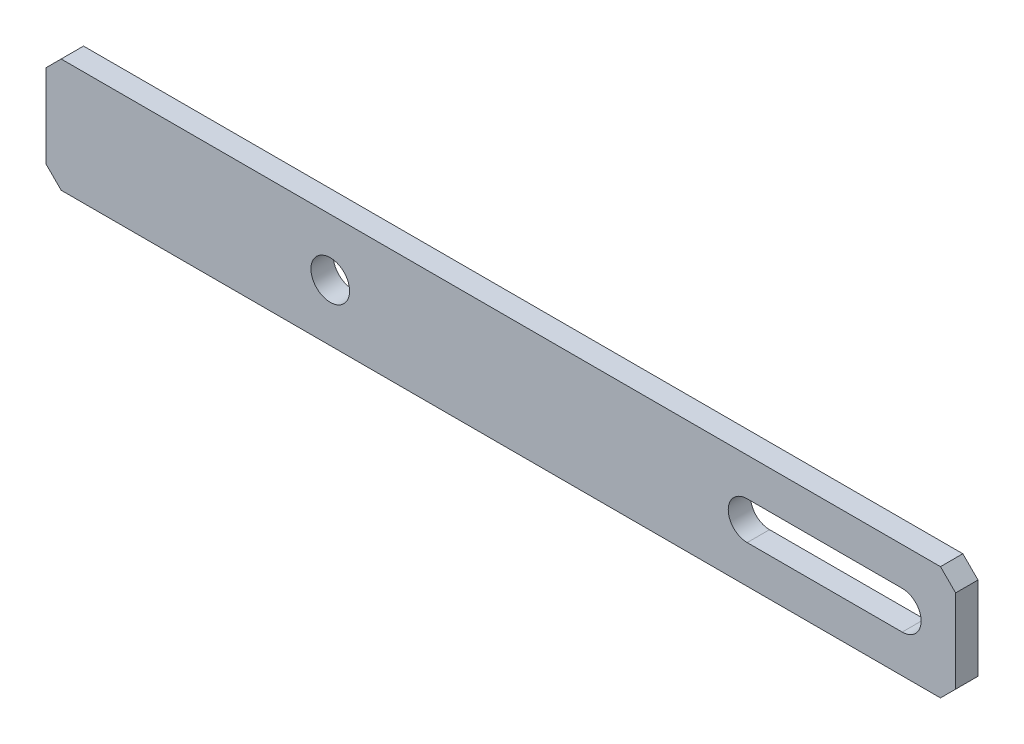
ISO-10303-21;
HEADER;
FILE_DESCRIPTION(('STEP AP214'),'2;1');
FILE_NAME('part.step','',(''),(''),'','','');
FILE_SCHEMA(('AUTOMOTIVE_DESIGN { 1 0 10303 214 1 1 1 1 }'));
ENDSEC;
DATA;
#1=APPLICATION_CONTEXT('core data for automotive mechanical design processes');
#2=APPLICATION_PROTOCOL_DEFINITION('international standard','automotive_design',2000,#1);
#3=PRODUCT_CONTEXT('',#1,'mechanical');
#4=PRODUCT('Part','Part','',(#3));
#5=PRODUCT_RELATED_PRODUCT_CATEGORY('part','',(#4));
#6=PRODUCT_DEFINITION_FORMATION('','',#4);
#7=PRODUCT_DEFINITION_CONTEXT('part definition',#1,'design');
#8=PRODUCT_DEFINITION('design','',#6,#7);
#9=PRODUCT_DEFINITION_SHAPE('','',#8);
#10=(LENGTH_UNIT() NAMED_UNIT(*) SI_UNIT(.MILLI.,.METRE.));
#11=(NAMED_UNIT(*) PLANE_ANGLE_UNIT() SI_UNIT($,.RADIAN.));
#12=(NAMED_UNIT(*) SI_UNIT($,.STERADIAN.) SOLID_ANGLE_UNIT());
#13=UNCERTAINTY_MEASURE_WITH_UNIT(LENGTH_MEASURE(1.E-05),#10,'distance_accuracy_value','');
#14=(GEOMETRIC_REPRESENTATION_CONTEXT(3) GLOBAL_UNCERTAINTY_ASSIGNED_CONTEXT((#13)) GLOBAL_UNIT_ASSIGNED_CONTEXT((#10,
#11,#12)) REPRESENTATION_CONTEXT('',''));
#15=CARTESIAN_POINT('',(0.,0.,0.));
#16=DIRECTION('',(0.,0.,1.));
#17=DIRECTION('',(1.,0.,0.));
#18=AXIS2_PLACEMENT_3D('',#15,#16,#17);
#19=CARTESIAN_POINT('',(0.,0.,2.95));
#20=DIRECTION('',(0.,0.,1.));
#21=DIRECTION('',(1.,0.,0.));
#22=AXIS2_PLACEMENT_3D('',#19,#20,#21);
#23=PLANE('',#22);
#24=DIRECTION('',(0.,1.,0.));
#25=VECTOR('',#24,1.);
#26=CARTESIAN_POINT('',(27.8800856531049,36.6809421841542,2.95));
#27=LINE('',#26,#25);
#28=CARTESIAN_POINT('',(27.8800856531049,23.6809421841542,2.95));
#29=VERTEX_POINT('',#28);
#30=CARTESIAN_POINT('',(27.8800856531049,34.6809421841541,2.95));
#31=VERTEX_POINT('',#30);
#32=EDGE_CURVE('E171',#29,#31,#27,.T.);
#33=ORIENTED_EDGE('',*,*,#32,.T.);
#34=DIRECTION('',(0.707106781186544,-0.707106781186551,0.));
#35=VECTOR('',#34,1.);
#36=CARTESIAN_POINT('',(31.2805139186297,31.2805139186294,2.95));
#37=LINE('',#36,#35);
#38=CARTESIAN_POINT('',(25.8800856531049,36.6809421841542,2.95));
#39=VERTEX_POINT('',#38);
#40=EDGE_CURVE('E214',#31,#39,#37,.F.);
#41=ORIENTED_EDGE('',*,*,#40,.T.);
#42=DIRECTION('',(-1.,0.,0.));
#43=VECTOR('',#42,1.);
#44=CARTESIAN_POINT('',(-92.1199143468951,36.6809421841542,2.95));
#45=LINE('',#44,#43);
#46=CARTESIAN_POINT('',(-90.119914346895,36.6809421841542,2.95));
#47=VERTEX_POINT('',#46);
#48=EDGE_CURVE('E174',#39,#47,#45,.T.);
#49=ORIENTED_EDGE('',*,*,#48,.T.);
#50=DIRECTION('',(0.70710678118655,0.707106781186545,0.));
#51=VECTOR('',#50,1.);
#52=CARTESIAN_POINT('',(-63.4004282655243,63.4004282655247,2.95));
#53=LINE('',#52,#51);
#54=CARTESIAN_POINT('',(-92.1199143468951,34.6809421841542,2.95));
#55=VERTEX_POINT('',#54);
#56=EDGE_CURVE('E209',#47,#55,#53,.F.);
#57=ORIENTED_EDGE('',*,*,#56,.T.);
#58=DIRECTION('',(0.,-1.,0.));
#59=VECTOR('',#58,1.);
#60=CARTESIAN_POINT('',(-92.1199143468951,36.6809421841542,2.95));
#61=LINE('',#60,#59);
#62=CARTESIAN_POINT('',(-92.1199143468951,23.6809421841542,2.95));
#63=VERTEX_POINT('',#62);
#64=EDGE_CURVE('E178',#55,#63,#61,.T.);
#65=ORIENTED_EDGE('',*,*,#64,.T.);
#66=DIRECTION('',(-0.707106781186545,0.70710678118655,0.));
#67=VECTOR('',#66,1.);
#68=CARTESIAN_POINT('',(-34.2194860813708,-34.2194860813705,2.95));
#69=LINE('',#68,#67);
#70=CARTESIAN_POINT('',(-90.1199143468951,21.6809421841542,2.95));
#71=VERTEX_POINT('',#70);
#72=EDGE_CURVE('E55',#63,#71,#69,.F.);
#73=ORIENTED_EDGE('',*,*,#72,.T.);
#74=DIRECTION('',(1.,0.,0.));
#75=VECTOR('',#74,1.);
#76=CARTESIAN_POINT('',(-92.1199143468951,21.6809421841542,2.95));
#77=LINE('',#76,#75);
#78=CARTESIAN_POINT('',(25.8800856531049,21.6809421841542,2.95));
#79=VERTEX_POINT('',#78);
#80=EDGE_CURVE('E180',#71,#79,#77,.T.);
#81=ORIENTED_EDGE('',*,*,#80,.T.);
#82=DIRECTION('',(-0.70710678118655,-0.707106781186545,0.));
#83=VECTOR('',#82,1.);
#84=CARTESIAN_POINT('',(2.09957173447529,-2.09957173447531,2.95));
#85=LINE('',#84,#83);
#86=EDGE_CURVE('E212',#79,#29,#85,.F.);
#87=ORIENTED_EDGE('',*,*,#86,.T.);
#88=EDGE_LOOP('',(#33,#41,#49,#57,#65,#73,#81,#87));
#89=FACE_BOUND('',#88,.T.);
#90=CARTESIAN_POINT('',(-54.6199143468951,29.1809421841542,2.95));
#91=DIRECTION('',(0.,0.,1.));
#92=DIRECTION('',(1.,0.,0.));
#93=AXIS2_PLACEMENT_3D('',#90,#91,#92);
#94=CIRCLE('',#93,2.55);
#95=CARTESIAN_POINT('',(-52.0699143468951,29.1809421841542,2.95));
#96=VERTEX_POINT('',#95);
#97=EDGE_CURVE('E165',#96,#96,#94,.T.);
#98=ORIENTED_EDGE('',*,*,#97,.F.);
#99=EDGE_LOOP('',(#98));
#100=FACE_BOUND('',#99,.T.);
#101=DIRECTION('',(1.,0.,0.));
#102=VECTOR('',#101,1.);
#103=CARTESIAN_POINT('',(0.380085653104949,26.6809421841542,2.95));
#104=LINE('',#103,#102);
#105=CARTESIAN_POINT('',(0.380085653104949,26.6809421841542,2.95));
#106=VERTEX_POINT('',#105);
#107=CARTESIAN_POINT('',(20.830085653105,26.6809421841542,2.95));
#108=VERTEX_POINT('',#107);
#109=EDGE_CURVE('E134',#106,#108,#104,.T.);
#110=ORIENTED_EDGE('',*,*,#109,.F.);
#111=CARTESIAN_POINT('',(0.380085653104949,29.1809421841542,2.95));
#112=DIRECTION('',(0.,0.,1.));
#113=DIRECTION('',(1.,0.,0.));
#114=AXIS2_PLACEMENT_3D('',#111,#112,#113);
#115=CIRCLE('',#114,2.5);
#116=CARTESIAN_POINT('',(0.380085653104949,31.6809421841542,2.95));
#117=VERTEX_POINT('',#116);
#118=EDGE_CURVE('E124',#117,#106,#115,.T.);
#119=ORIENTED_EDGE('',*,*,#118,.F.);
#120=DIRECTION('',(-1.,0.,0.));
#121=VECTOR('',#120,1.);
#122=CARTESIAN_POINT('',(0.380085653104949,31.6809421841542,2.95));
#123=LINE('',#122,#121);
#124=CARTESIAN_POINT('',(20.830085653105,31.6809421841542,2.95));
#125=VERTEX_POINT('',#124);
#126=EDGE_CURVE('E149',#125,#117,#123,.T.);
#127=ORIENTED_EDGE('',*,*,#126,.F.);
#128=CARTESIAN_POINT('',(20.830085653105,29.1809421841542,2.95));
#129=DIRECTION('',(0.,0.,1.));
#130=DIRECTION('',(1.,0.,0.));
#131=AXIS2_PLACEMENT_3D('',#128,#129,#130);
#132=CIRCLE('',#131,2.5);
#133=EDGE_CURVE('E147',#108,#125,#132,.T.);
#134=ORIENTED_EDGE('',*,*,#133,.F.);
#135=EDGE_LOOP('',(#110,#119,#127,#134));
#136=FACE_BOUND('',#135,.T.);
#137=ADVANCED_FACE('F33',(#89,#100,#136),#23,.T.);
#138=CARTESIAN_POINT('',(0.,0.,0.));
#139=DIRECTION('',(0.,0.,1.));
#140=DIRECTION('',(1.,0.,0.));
#141=AXIS2_PLACEMENT_3D('',#138,#139,#140);
#142=PLANE('',#141);
#143=CARTESIAN_POINT('',(-54.6199143468951,29.1809421841542,0.));
#144=DIRECTION('',(0.,0.,1.));
#145=DIRECTION('',(1.,0.,0.));
#146=AXIS2_PLACEMENT_3D('',#143,#144,#145);
#147=CIRCLE('',#146,2.55);
#148=CARTESIAN_POINT('',(-52.0699143468951,29.1809421841542,0.));
#149=VERTEX_POINT('',#148);
#150=EDGE_CURVE('E142',#149,#149,#147,.T.);
#151=ORIENTED_EDGE('',*,*,#150,.T.);
#152=EDGE_LOOP('',(#151));
#153=FACE_BOUND('',#152,.T.);
#154=DIRECTION('',(-1.,0.,0.));
#155=VECTOR('',#154,1.);
#156=CARTESIAN_POINT('',(-92.1199143468951,36.6809421841542,0.));
#157=LINE('',#156,#155);
#158=CARTESIAN_POINT('',(25.8800856531049,36.6809421841542,0.));
#159=VERTEX_POINT('',#158);
#160=CARTESIAN_POINT('',(-90.119914346895,36.6809421841542,0.));
#161=VERTEX_POINT('',#160);
#162=EDGE_CURVE('E185',#159,#161,#157,.T.);
#163=ORIENTED_EDGE('',*,*,#162,.F.);
#164=DIRECTION('',(-0.707106781186544,0.707106781186551,0.));
#165=VECTOR('',#164,1.);
#166=CARTESIAN_POINT('',(25.8800856531049,36.6809421841542,0.));
#167=LINE('',#166,#165);
#168=CARTESIAN_POINT('',(27.8800856531049,34.6809421841541,0.));
#169=VERTEX_POINT('',#168);
#170=EDGE_CURVE('E202',#159,#169,#167,.F.);
#171=ORIENTED_EDGE('',*,*,#170,.T.);
#172=DIRECTION('',(0.,1.,0.));
#173=VECTOR('',#172,1.);
#174=CARTESIAN_POINT('',(27.8800856531049,36.6809421841542,0.));
#175=LINE('',#174,#173);
#176=CARTESIAN_POINT('',(27.8800856531049,23.6809421841542,0.));
#177=VERTEX_POINT('',#176);
#178=EDGE_CURVE('E168',#177,#169,#175,.T.);
#179=ORIENTED_EDGE('',*,*,#178,.F.);
#180=DIRECTION('',(0.70710678118655,0.707106781186545,0.));
#181=VECTOR('',#180,1.);
#182=CARTESIAN_POINT('',(27.8800856531049,23.6809421841542,0.));
#183=LINE('',#182,#181);
#184=CARTESIAN_POINT('',(25.8800856531049,21.6809421841542,0.));
#185=VERTEX_POINT('',#184);
#186=EDGE_CURVE('E200',#177,#185,#183,.F.);
#187=ORIENTED_EDGE('',*,*,#186,.T.);
#188=DIRECTION('',(1.,0.,0.));
#189=VECTOR('',#188,1.);
#190=CARTESIAN_POINT('',(-92.1199143468951,21.6809421841542,0.));
#191=LINE('',#190,#189);
#192=CARTESIAN_POINT('',(-90.1199143468951,21.6809421841542,0.));
#193=VERTEX_POINT('',#192);
#194=EDGE_CURVE('E175',#193,#185,#191,.T.);
#195=ORIENTED_EDGE('',*,*,#194,.F.);
#196=DIRECTION('',(0.707106781186545,-0.70710678118655,0.));
#197=VECTOR('',#196,1.);
#198=CARTESIAN_POINT('',(-90.1199143468951,21.6809421841542,0.));
#199=LINE('',#198,#197);
#200=CARTESIAN_POINT('',(-92.1199143468951,23.6809421841542,0.));
#201=VERTEX_POINT('',#200);
#202=EDGE_CURVE('E198',#193,#201,#199,.F.);
#203=ORIENTED_EDGE('',*,*,#202,.T.);
#204=DIRECTION('',(0.,-1.,0.));
#205=VECTOR('',#204,1.);
#206=CARTESIAN_POINT('',(-92.1199143468951,36.6809421841542,0.));
#207=LINE('',#206,#205);
#208=CARTESIAN_POINT('',(-92.1199143468951,34.6809421841542,0.));
#209=VERTEX_POINT('',#208);
#210=EDGE_CURVE('E188',#209,#201,#207,.T.);
#211=ORIENTED_EDGE('',*,*,#210,.F.);
#212=DIRECTION('',(-0.70710678118655,-0.707106781186545,0.));
#213=VECTOR('',#212,1.);
#214=CARTESIAN_POINT('',(-92.1199143468951,34.6809421841542,0.));
#215=LINE('',#214,#213);
#216=EDGE_CURVE('E196',#209,#161,#215,.F.);
#217=ORIENTED_EDGE('',*,*,#216,.T.);
#218=EDGE_LOOP('',(#163,#171,#179,#187,#195,#203,#211,#217));
#219=FACE_BOUND('',#218,.T.);
#220=CARTESIAN_POINT('',(0.380085653104949,29.1809421841542,0.));
#221=DIRECTION('',(0.,0.,1.));
#222=DIRECTION('',(1.,0.,0.));
#223=AXIS2_PLACEMENT_3D('',#220,#221,#222);
#224=CIRCLE('',#223,2.5);
#225=CARTESIAN_POINT('',(0.380085653104949,31.6809421841542,0.));
#226=VERTEX_POINT('',#225);
#227=CARTESIAN_POINT('',(0.380085653104949,26.6809421841542,0.));
#228=VERTEX_POINT('',#227);
#229=EDGE_CURVE('E153',#226,#228,#224,.T.);
#230=ORIENTED_EDGE('',*,*,#229,.T.);
#231=DIRECTION('',(1.,0.,0.));
#232=VECTOR('',#231,1.);
#233=CARTESIAN_POINT('',(0.380085653104949,26.6809421841542,0.));
#234=LINE('',#233,#232);
#235=CARTESIAN_POINT('',(20.830085653105,26.6809421841542,0.));
#236=VERTEX_POINT('',#235);
#237=EDGE_CURVE('E141',#228,#236,#234,.T.);
#238=ORIENTED_EDGE('',*,*,#237,.T.);
#239=CARTESIAN_POINT('',(20.830085653105,29.1809421841542,0.));
#240=DIRECTION('',(0.,0.,1.));
#241=DIRECTION('',(1.,0.,0.));
#242=AXIS2_PLACEMENT_3D('',#239,#240,#241);
#243=CIRCLE('',#242,2.5);
#244=CARTESIAN_POINT('',(20.830085653105,31.6809421841542,0.));
#245=VERTEX_POINT('',#244);
#246=EDGE_CURVE('E156',#236,#245,#243,.T.);
#247=ORIENTED_EDGE('',*,*,#246,.T.);
#248=DIRECTION('',(-1.,0.,0.));
#249=VECTOR('',#248,1.);
#250=CARTESIAN_POINT('',(0.380085653104949,31.6809421841542,0.));
#251=LINE('',#250,#249);
#252=EDGE_CURVE('E135',#245,#226,#251,.T.);
#253=ORIENTED_EDGE('',*,*,#252,.T.);
#254=EDGE_LOOP('',(#230,#238,#247,#253));
#255=FACE_BOUND('',#254,.T.);
#256=ADVANCED_FACE('F230',(#153,#219,#255),#142,.F.);
#257=CARTESIAN_POINT('',(27.8800856531049,36.6809421841542,2.95));
#258=DIRECTION('',(-1.,0.,0.));
#259=DIRECTION('',(0.,-1.,0.));
#260=AXIS2_PLACEMENT_3D('',#257,#258,#259);
#261=PLANE('',#260);
#262=ORIENTED_EDGE('',*,*,#178,.T.);
#263=DIRECTION('',(0.,0.,1.));
#264=VECTOR('',#263,1.);
#265=CARTESIAN_POINT('',(27.8800856531049,34.6809421841541,2.95));
#266=LINE('',#265,#264);
#267=EDGE_CURVE('E207',#169,#31,#266,.T.);
#268=ORIENTED_EDGE('',*,*,#267,.T.);
#269=ORIENTED_EDGE('',*,*,#32,.F.);
#270=DIRECTION('',(0.,0.,-1.));
#271=VECTOR('',#270,1.);
#272=CARTESIAN_POINT('',(27.8800856531049,23.6809421841542,2.95));
#273=LINE('',#272,#271);
#274=EDGE_CURVE('E204',#29,#177,#273,.T.);
#275=ORIENTED_EDGE('',*,*,#274,.T.);
#276=EDGE_LOOP('',(#262,#268,#269,#275));
#277=FACE_BOUND('',#276,.T.);
#278=ADVANCED_FACE('F245',(#277),#261,.F.);
#279=CARTESIAN_POINT('',(-92.1199143468951,36.6809421841542,2.95));
#280=DIRECTION('',(0.,-1.,0.));
#281=DIRECTION('',(0.,0.,-1.));
#282=AXIS2_PLACEMENT_3D('',#279,#280,#281);
#283=PLANE('',#282);
#284=ORIENTED_EDGE('',*,*,#48,.F.);
#285=DIRECTION('',(0.,0.,-1.));
#286=VECTOR('',#285,1.);
#287=CARTESIAN_POINT('',(25.8800856531049,36.6809421841542,2.95));
#288=LINE('',#287,#286);
#289=EDGE_CURVE('E193',#39,#159,#288,.T.);
#290=ORIENTED_EDGE('',*,*,#289,.T.);
#291=ORIENTED_EDGE('',*,*,#162,.T.);
#292=DIRECTION('',(0.,0.,1.));
#293=VECTOR('',#292,1.);
#294=CARTESIAN_POINT('',(-90.119914346895,36.6809421841542,2.95));
#295=LINE('',#294,#293);
#296=EDGE_CURVE('E182',#161,#47,#295,.T.);
#297=ORIENTED_EDGE('',*,*,#296,.T.);
#298=EDGE_LOOP('',(#284,#290,#291,#297));
#299=FACE_BOUND('',#298,.T.);
#300=ADVANCED_FACE('F253',(#299),#283,.F.);
#301=CARTESIAN_POINT('',(-92.1199143468951,36.6809421841542,2.95));
#302=DIRECTION('',(1.,0.,0.));
#303=DIRECTION('',(0.,0.,-1.));
#304=AXIS2_PLACEMENT_3D('',#301,#302,#303);
#305=PLANE('',#304);
#306=ORIENTED_EDGE('',*,*,#210,.T.);
#307=DIRECTION('',(0.,0.,1.));
#308=VECTOR('',#307,1.);
#309=CARTESIAN_POINT('',(-92.1199143468951,23.6809421841542,2.95));
#310=LINE('',#309,#308);
#311=EDGE_CURVE('E11',#201,#63,#310,.T.);
#312=ORIENTED_EDGE('',*,*,#311,.T.);
#313=ORIENTED_EDGE('',*,*,#64,.F.);
#314=DIRECTION('',(0.,0.,-1.));
#315=VECTOR('',#314,1.);
#316=CARTESIAN_POINT('',(-92.1199143468951,34.6809421841542,2.95));
#317=LINE('',#316,#315);
#318=EDGE_CURVE('E41',#55,#209,#317,.T.);
#319=ORIENTED_EDGE('',*,*,#318,.T.);
#320=EDGE_LOOP('',(#306,#312,#313,#319));
#321=FACE_BOUND('',#320,.T.);
#322=ADVANCED_FACE('F224',(#321),#305,.F.);
#323=CARTESIAN_POINT('',(-92.1199143468951,21.6809421841542,2.95));
#324=DIRECTION('',(0.,1.,0.));
#325=DIRECTION('',(0.,0.,1.));
#326=AXIS2_PLACEMENT_3D('',#323,#324,#325);
#327=PLANE('',#326);
#328=ORIENTED_EDGE('',*,*,#194,.T.);
#329=DIRECTION('',(0.,0.,1.));
#330=VECTOR('',#329,1.);
#331=CARTESIAN_POINT('',(25.8800856531049,21.6809421841542,2.95));
#332=LINE('',#331,#330);
#333=EDGE_CURVE('E48',#185,#79,#332,.T.);
#334=ORIENTED_EDGE('',*,*,#333,.T.);
#335=ORIENTED_EDGE('',*,*,#80,.F.);
#336=DIRECTION('',(0.,0.,-1.));
#337=VECTOR('',#336,1.);
#338=CARTESIAN_POINT('',(-90.1199143468951,21.6809421841542,2.95));
#339=LINE('',#338,#337);
#340=EDGE_CURVE('E216',#71,#193,#339,.T.);
#341=ORIENTED_EDGE('',*,*,#340,.T.);
#342=EDGE_LOOP('',(#328,#334,#335,#341));
#343=FACE_BOUND('',#342,.T.);
#344=ADVANCED_FACE('F236',(#343),#327,.F.);
#345=CARTESIAN_POINT('',(-54.6199143468951,29.1809421841542,2.95));
#346=DIRECTION('',(0.,0.,-1.));
#347=DIRECTION('',(-1.,0.,0.));
#348=AXIS2_PLACEMENT_3D('',#345,#346,#347);
#349=CYLINDRICAL_SURFACE('',#348,2.55);
#350=ORIENTED_EDGE('',*,*,#97,.T.);
#351=EDGE_LOOP('',(#350));
#352=FACE_BOUND('',#351,.T.);
#353=ORIENTED_EDGE('',*,*,#150,.F.);
#354=EDGE_LOOP('',(#353));
#355=FACE_BOUND('',#354,.T.);
#356=ADVANCED_FACE('F268',(#352,#355),#349,.F.);
#357=CARTESIAN_POINT('',(0.380085653104949,29.1809421841542,2.95));
#358=DIRECTION('',(0.,0.,-1.));
#359=DIRECTION('',(-1.,0.,0.));
#360=AXIS2_PLACEMENT_3D('',#357,#358,#359);
#361=CYLINDRICAL_SURFACE('',#360,2.5);
#362=ORIENTED_EDGE('',*,*,#229,.F.);
#363=DIRECTION('',(0.,0.,-1.));
#364=VECTOR('',#363,1.);
#365=CARTESIAN_POINT('',(0.380085653104949,31.6809421841542,2.95));
#366=LINE('',#365,#364);
#367=EDGE_CURVE('E130',#117,#226,#366,.T.);
#368=ORIENTED_EDGE('',*,*,#367,.F.);
#369=ORIENTED_EDGE('',*,*,#118,.T.);
#370=DIRECTION('',(0.,0.,-1.));
#371=VECTOR('',#370,1.);
#372=CARTESIAN_POINT('',(0.380085653104949,26.6809421841542,2.95));
#373=LINE('',#372,#371);
#374=EDGE_CURVE('E127',#106,#228,#373,.T.);
#375=ORIENTED_EDGE('',*,*,#374,.T.);
#376=EDGE_LOOP('',(#362,#368,#369,#375));
#377=FACE_BOUND('',#376,.T.);
#378=ADVANCED_FACE('F126',(#377),#361,.F.);
#379=CARTESIAN_POINT('',(0.380085653104949,26.6809421841542,2.95));
#380=DIRECTION('',(0.,1.,0.));
#381=DIRECTION('',(0.,0.,1.));
#382=AXIS2_PLACEMENT_3D('',#379,#380,#381);
#383=PLANE('',#382);
#384=ORIENTED_EDGE('',*,*,#237,.F.);
#385=ORIENTED_EDGE('',*,*,#374,.F.);
#386=ORIENTED_EDGE('',*,*,#109,.T.);
#387=DIRECTION('',(0.,0.,-1.));
#388=VECTOR('',#387,1.);
#389=CARTESIAN_POINT('',(20.830085653105,26.6809421841542,2.95));
#390=LINE('',#389,#388);
#391=EDGE_CURVE('E143',#108,#236,#390,.T.);
#392=ORIENTED_EDGE('',*,*,#391,.T.);
#393=EDGE_LOOP('',(#384,#385,#386,#392));
#394=FACE_BOUND('',#393,.T.);
#395=ADVANCED_FACE('F138',(#394),#383,.T.);
#396=CARTESIAN_POINT('',(20.830085653105,29.1809421841542,2.95));
#397=DIRECTION('',(0.,0.,-1.));
#398=DIRECTION('',(-1.,0.,0.));
#399=AXIS2_PLACEMENT_3D('',#396,#397,#398);
#400=CYLINDRICAL_SURFACE('',#399,2.5);
#401=ORIENTED_EDGE('',*,*,#246,.F.);
#402=ORIENTED_EDGE('',*,*,#391,.F.);
#403=ORIENTED_EDGE('',*,*,#133,.T.);
#404=DIRECTION('',(0.,0.,-1.));
#405=VECTOR('',#404,1.);
#406=CARTESIAN_POINT('',(20.830085653105,31.6809421841542,2.95));
#407=LINE('',#406,#405);
#408=EDGE_CURVE('E162',#125,#245,#407,.T.);
#409=ORIENTED_EDGE('',*,*,#408,.T.);
#410=EDGE_LOOP('',(#401,#402,#403,#409));
#411=FACE_BOUND('',#410,.T.);
#412=ADVANCED_FACE('F310',(#411),#400,.F.);
#413=CARTESIAN_POINT('',(0.380085653104949,31.6809421841542,2.95));
#414=DIRECTION('',(0.,-1.,0.));
#415=DIRECTION('',(1.,0.,0.));
#416=AXIS2_PLACEMENT_3D('',#413,#414,#415);
#417=PLANE('',#416);
#418=ORIENTED_EDGE('',*,*,#252,.F.);
#419=ORIENTED_EDGE('',*,*,#408,.F.);
#420=ORIENTED_EDGE('',*,*,#126,.T.);
#421=ORIENTED_EDGE('',*,*,#367,.T.);
#422=EDGE_LOOP('',(#418,#419,#420,#421));
#423=FACE_BOUND('',#422,.T.);
#424=ADVANCED_FACE('F281',(#423),#417,.T.);
#425=CARTESIAN_POINT('',(25.8800856531049,36.6809421841542,2.95));
#426=DIRECTION('',(-0.707106781186551,-0.707106781186544,0.));
#427=DIRECTION('',(0.,0.,-1.));
#428=AXIS2_PLACEMENT_3D('',#425,#426,#427);
#429=PLANE('',#428);
#430=ORIENTED_EDGE('',*,*,#40,.F.);
#431=ORIENTED_EDGE('',*,*,#267,.F.);
#432=ORIENTED_EDGE('',*,*,#170,.F.);
#433=ORIENTED_EDGE('',*,*,#289,.F.);
#434=EDGE_LOOP('',(#430,#431,#432,#433));
#435=FACE_BOUND('',#434,.T.);
#436=ADVANCED_FACE('F250',(#435),#429,.F.);
#437=CARTESIAN_POINT('',(27.8800856531049,23.6809421841542,2.95));
#438=DIRECTION('',(-0.707106781186545,0.70710678118655,0.));
#439=DIRECTION('',(0.,0.,-1.));
#440=AXIS2_PLACEMENT_3D('',#437,#438,#439);
#441=PLANE('',#440);
#442=ORIENTED_EDGE('',*,*,#86,.F.);
#443=ORIENTED_EDGE('',*,*,#333,.F.);
#444=ORIENTED_EDGE('',*,*,#186,.F.);
#445=ORIENTED_EDGE('',*,*,#274,.F.);
#446=EDGE_LOOP('',(#442,#443,#444,#445));
#447=FACE_BOUND('',#446,.T.);
#448=ADVANCED_FACE('F242',(#447),#441,.F.);
#449=CARTESIAN_POINT('',(-90.1199143468951,21.6809421841542,2.95));
#450=DIRECTION('',(0.70710678118655,0.707106781186545,0.));
#451=DIRECTION('',(0.,0.,-1.));
#452=AXIS2_PLACEMENT_3D('',#449,#450,#451);
#453=PLANE('',#452);
#454=ORIENTED_EDGE('',*,*,#72,.F.);
#455=ORIENTED_EDGE('',*,*,#311,.F.);
#456=ORIENTED_EDGE('',*,*,#202,.F.);
#457=ORIENTED_EDGE('',*,*,#340,.F.);
#458=EDGE_LOOP('',(#454,#455,#456,#457));
#459=FACE_BOUND('',#458,.T.);
#460=ADVANCED_FACE('F235',(#459),#453,.F.);
#461=CARTESIAN_POINT('',(-92.1199143468951,34.6809421841542,2.95));
#462=DIRECTION('',(0.707106781186545,-0.70710678118655,0.));
#463=DIRECTION('',(0.,0.,-1.));
#464=AXIS2_PLACEMENT_3D('',#461,#462,#463);
#465=PLANE('',#464);
#466=ORIENTED_EDGE('',*,*,#56,.F.);
#467=ORIENTED_EDGE('',*,*,#296,.F.);
#468=ORIENTED_EDGE('',*,*,#216,.F.);
#469=ORIENTED_EDGE('',*,*,#318,.F.);
#470=EDGE_LOOP('',(#466,#467,#468,#469));
#471=FACE_BOUND('',#470,.T.);
#472=ADVANCED_FACE('F35',(#471),#465,.F.);
#473=CLOSED_SHELL('',(#137,#256,#278,#300,#322,#344,#356,#378,#395,#412,#424,#436,#448,#460,#472));
#474=MANIFOLD_SOLID_BREP('B2',#473);
#475=ADVANCED_BREP_SHAPE_REPRESENTATION('',(#18,#474),#14);
#476=SHAPE_DEFINITION_REPRESENTATION(#9,#475);
ENDSEC;
END-ISO-10303-21;
